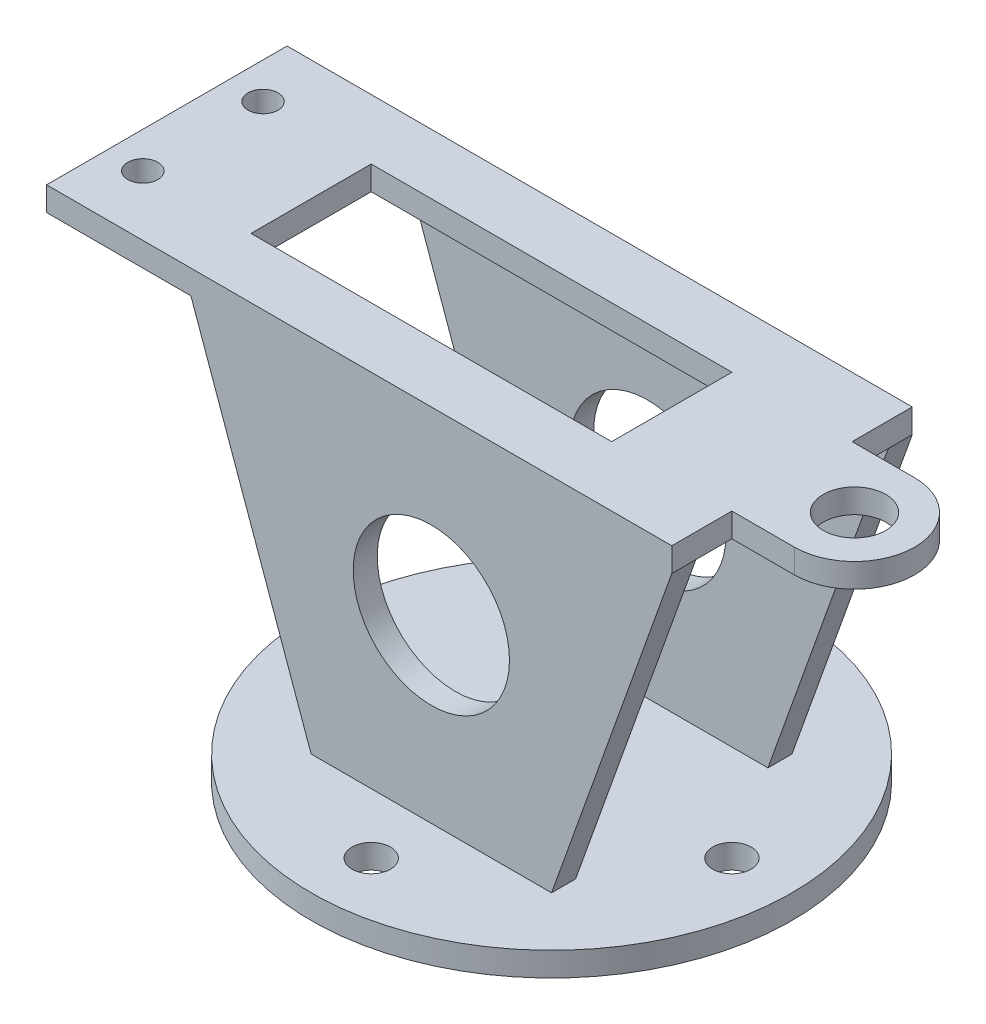
ISO-10303-21;
HEADER;
FILE_DESCRIPTION(('STEP AP214'),'2;1');
FILE_NAME('part.step','',(''),(''),'','','');
FILE_SCHEMA(('AUTOMOTIVE_DESIGN { 1 0 10303 214 1 1 1 1 }'));
ENDSEC;
DATA;
#1=APPLICATION_CONTEXT('core data for automotive mechanical design processes');
#2=APPLICATION_PROTOCOL_DEFINITION('international standard','automotive_design',2000,#1);
#3=PRODUCT_CONTEXT('',#1,'mechanical');
#4=PRODUCT('Part','Part','',(#3));
#5=PRODUCT_RELATED_PRODUCT_CATEGORY('part','',(#4));
#6=PRODUCT_DEFINITION_FORMATION('','',#4);
#7=PRODUCT_DEFINITION_CONTEXT('part definition',#1,'design');
#8=PRODUCT_DEFINITION('design','',#6,#7);
#9=PRODUCT_DEFINITION_SHAPE('','',#8);
#10=(LENGTH_UNIT() NAMED_UNIT(*) SI_UNIT(.MILLI.,.METRE.));
#11=(NAMED_UNIT(*) PLANE_ANGLE_UNIT() SI_UNIT($,.RADIAN.));
#12=(NAMED_UNIT(*) SI_UNIT($,.STERADIAN.) SOLID_ANGLE_UNIT());
#13=UNCERTAINTY_MEASURE_WITH_UNIT(LENGTH_MEASURE(1.E-05),#10,'distance_accuracy_value','');
#14=(GEOMETRIC_REPRESENTATION_CONTEXT(3) GLOBAL_UNCERTAINTY_ASSIGNED_CONTEXT((#13)) GLOBAL_UNIT_ASSIGNED_CONTEXT((#10,
#11,#12)) REPRESENTATION_CONTEXT('',''));
#15=CARTESIAN_POINT('',(0.,0.,0.));
#16=DIRECTION('',(0.,0.,1.));
#17=DIRECTION('',(1.,0.,0.));
#18=AXIS2_PLACEMENT_3D('',#15,#16,#17);
#19=CARTESIAN_POINT('',(50.8,0.,-20.32));
#20=DIRECTION('',(0.,0.,1.));
#21=DIRECTION('',(0.,-1.,0.));
#22=AXIS2_PLACEMENT_3D('',#19,#20,#21);
#23=PLANE('',#22);
#24=CARTESIAN_POINT('',(0.,38.1,-20.32));
#25=DIRECTION('',(0.,0.,1.));
#26=DIRECTION('',(0.,-1.,0.));
#27=AXIS2_PLACEMENT_3D('',#24,#25,#26);
#28=CIRCLE('',#27,16.51);
#29=CARTESIAN_POINT('',(0.,21.59,-20.32));
#30=VERTEX_POINT('',#29);
#31=EDGE_CURVE('E715',#30,#30,#28,.T.);
#32=ORIENTED_EDGE('',*,*,#31,.F.);
#33=EDGE_LOOP('',(#32));
#34=FACE_BOUND('',#33,.T.);
#35=DIRECTION('',(-1.,0.,0.));
#36=VECTOR('',#35,1.);
#37=CARTESIAN_POINT('',(50.8,0.,-20.32));
#38=LINE('',#37,#36);
#39=CARTESIAN_POINT('',(25.4,0.,-20.32));
#40=VERTEX_POINT('',#39);
#41=CARTESIAN_POINT('',(-25.4,0.,-20.32));
#42=VERTEX_POINT('',#41);
#43=EDGE_CURVE('E241',#40,#42,#38,.T.);
#44=ORIENTED_EDGE('',*,*,#43,.F.);
#45=DIRECTION('',(0.336336396998156,0.941741911594838,0.));
#46=VECTOR('',#45,1.);
#47=CARTESIAN_POINT('',(28.2733031674208,8.04524886877828,-20.32));
#48=LINE('',#47,#46);
#49=CARTESIAN_POINT('',(50.8,71.12,-20.32));
#50=VERTEX_POINT('',#49);
#51=EDGE_CURVE('E203',#40,#50,#48,.T.);
#52=ORIENTED_EDGE('',*,*,#51,.T.);
#53=DIRECTION('',(-1.,0.,0.));
#54=VECTOR('',#53,1.);
#55=CARTESIAN_POINT('',(50.8,71.12,-20.32));
#56=LINE('',#55,#54);
#57=CARTESIAN_POINT('',(-50.8,71.12,-20.32));
#58=VERTEX_POINT('',#57);
#59=EDGE_CURVE('E44',#50,#58,#56,.T.);
#60=ORIENTED_EDGE('',*,*,#59,.T.);
#61=DIRECTION('',(0.336336396998156,-0.941741911594838,0.));
#62=VECTOR('',#61,1.);
#63=CARTESIAN_POINT('',(-16.7800904977376,-24.1357466063348,-20.32));
#64=LINE('',#63,#62);
#65=EDGE_CURVE('E279',#58,#42,#64,.T.);
#66=ORIENTED_EDGE('',*,*,#65,.T.);
#67=EDGE_LOOP('',(#44,#52,#60,#66));
#68=FACE_BOUND('',#67,.T.);
#69=ADVANCED_FACE('F35',(#34,#68),#23,.T.);
#70=CARTESIAN_POINT('',(50.8,0.,-25.4));
#71=DIRECTION('',(0.,0.,1.));
#72=DIRECTION('',(1.,0.,0.));
#73=AXIS2_PLACEMENT_3D('',#70,#71,#72);
#74=PLANE('',#73);
#75=CARTESIAN_POINT('',(0.,38.1,-25.4));
#76=DIRECTION('',(0.,0.,1.));
#77=DIRECTION('',(1.,0.,0.));
#78=AXIS2_PLACEMENT_3D('',#75,#76,#77);
#79=CIRCLE('',#78,16.51);
#80=CARTESIAN_POINT('',(16.51,38.1,-25.4));
#81=VERTEX_POINT('',#80);
#82=EDGE_CURVE('E718',#81,#81,#79,.T.);
#83=ORIENTED_EDGE('',*,*,#82,.T.);
#84=EDGE_LOOP('',(#83));
#85=FACE_BOUND('',#84,.T.);
#86=DIRECTION('',(0.336336396998156,0.941741911594838,0.));
#87=VECTOR('',#86,1.);
#88=CARTESIAN_POINT('',(28.2733031674208,8.04524886877828,-25.4));
#89=LINE('',#88,#87);
#90=CARTESIAN_POINT('',(25.4,0.,-25.4));
#91=VERTEX_POINT('',#90);
#92=CARTESIAN_POINT('',(50.8,71.12,-25.4000025));
#93=VERTEX_POINT('',#92);
#94=EDGE_CURVE('E52',#91,#93,#89,.T.);
#95=ORIENTED_EDGE('',*,*,#94,.F.);
#96=DIRECTION('',(-1.,0.,0.));
#97=VECTOR('',#96,1.);
#98=CARTESIAN_POINT('',(50.8,0.,-25.4));
#99=LINE('',#98,#97);
#100=CARTESIAN_POINT('',(-25.4,0.,-25.4));
#101=VERTEX_POINT('',#100);
#102=EDGE_CURVE('E244',#91,#101,#99,.T.);
#103=ORIENTED_EDGE('',*,*,#102,.T.);
#104=DIRECTION('',(0.336336396998156,-0.941741911594838,0.));
#105=VECTOR('',#104,1.);
#106=CARTESIAN_POINT('',(-16.7800904977376,-24.1357466063348,-25.4));
#107=LINE('',#106,#105);
#108=CARTESIAN_POINT('',(-50.8,71.12,-25.4000225));
#109=VERTEX_POINT('',#108);
#110=EDGE_CURVE('E278',#109,#101,#107,.T.);
#111=ORIENTED_EDGE('',*,*,#110,.F.);
#112=DIRECTION('',(-1.,0.,0.));
#113=VECTOR('',#112,1.);
#114=CARTESIAN_POINT('',(0.,71.12,-25.4));
#115=LINE('',#114,#113);
#116=CARTESIAN_POINT('',(-81.28,71.12,-25.4));
#117=VERTEX_POINT('',#116);
#118=EDGE_CURVE('E266',#109,#117,#115,.T.);
#119=ORIENTED_EDGE('',*,*,#118,.T.);
#120=DIRECTION('',(0.,1.,0.));
#121=VECTOR('',#120,1.);
#122=CARTESIAN_POINT('',(-81.28,11.8775287483717,-25.4));
#123=LINE('',#122,#121);
#124=CARTESIAN_POINT('',(-81.28,76.2,-25.4));
#125=VERTEX_POINT('',#124);
#126=EDGE_CURVE('E268',#117,#125,#123,.T.);
#127=ORIENTED_EDGE('',*,*,#126,.T.);
#128=DIRECTION('',(-1.,0.,0.));
#129=VECTOR('',#128,1.);
#130=CARTESIAN_POINT('',(50.8,76.2,-25.4));
#131=LINE('',#130,#129);
#132=CARTESIAN_POINT('',(50.8,76.2,-25.4));
#133=VERTEX_POINT('',#132);
#134=EDGE_CURVE('E246',#133,#125,#131,.T.);
#135=ORIENTED_EDGE('',*,*,#134,.F.);
#136=DIRECTION('',(0.,1.,0.));
#137=VECTOR('',#136,1.);
#138=CARTESIAN_POINT('',(50.8,0.,-25.4));
#139=LINE('',#138,#137);
#140=EDGE_CURVE('E215',#93,#133,#139,.T.);
#141=ORIENTED_EDGE('',*,*,#140,.F.);
#142=EDGE_LOOP('',(#95,#103,#111,#119,#127,#135,#141));
#143=FACE_BOUND('',#142,.T.);
#144=ADVANCED_FACE('F428',(#85,#143),#74,.F.);
#145=CARTESIAN_POINT('',(50.8,0.,25.4));
#146=DIRECTION('',(0.,0.,1.));
#147=DIRECTION('',(1.,0.,0.));
#148=AXIS2_PLACEMENT_3D('',#145,#146,#147);
#149=PLANE('',#148);
#150=CARTESIAN_POINT('',(0.,38.1,25.4));
#151=DIRECTION('',(0.,0.,1.));
#152=DIRECTION('',(1.,0.,0.));
#153=AXIS2_PLACEMENT_3D('',#150,#151,#152);
#154=CIRCLE('',#153,16.51);
#155=CARTESIAN_POINT('',(16.51,38.1,25.4));
#156=VERTEX_POINT('',#155);
#157=EDGE_CURVE('E722',#156,#156,#154,.T.);
#158=ORIENTED_EDGE('',*,*,#157,.F.);
#159=EDGE_LOOP('',(#158));
#160=FACE_BOUND('',#159,.T.);
#161=DIRECTION('',(-1.,0.,0.));
#162=VECTOR('',#161,1.);
#163=CARTESIAN_POINT('',(50.8,0.,25.4));
#164=LINE('',#163,#162);
#165=CARTESIAN_POINT('',(25.4,0.,25.4));
#166=VERTEX_POINT('',#165);
#167=CARTESIAN_POINT('',(-25.4,0.,25.4));
#168=VERTEX_POINT('',#167);
#169=EDGE_CURVE('E169',#166,#168,#164,.T.);
#170=ORIENTED_EDGE('',*,*,#169,.F.);
#171=DIRECTION('',(0.336336396998156,0.941741911594837,0.));
#172=VECTOR('',#171,1.);
#173=CARTESIAN_POINT('',(22.5266968325792,-8.04524886877828,25.4));
#174=LINE('',#173,#172);
#175=CARTESIAN_POINT('',(50.8,71.12,25.4));
#176=VERTEX_POINT('',#175);
#177=EDGE_CURVE('E172',#166,#176,#174,.T.);
#178=ORIENTED_EDGE('',*,*,#177,.T.);
#179=DIRECTION('',(0.,1.,0.));
#180=VECTOR('',#179,1.);
#181=CARTESIAN_POINT('',(50.8,0.,25.4));
#182=LINE('',#181,#180);
#183=CARTESIAN_POINT('',(50.8,76.2,25.4));
#184=VERTEX_POINT('',#183);
#185=EDGE_CURVE('E226',#176,#184,#182,.T.);
#186=ORIENTED_EDGE('',*,*,#185,.T.);
#187=DIRECTION('',(-1.,0.,0.));
#188=VECTOR('',#187,1.);
#189=CARTESIAN_POINT('',(50.8,76.2,25.4));
#190=LINE('',#189,#188);
#191=CARTESIAN_POINT('',(-81.28,76.2,25.4));
#192=VERTEX_POINT('',#191);
#193=EDGE_CURVE('E179',#184,#192,#190,.T.);
#194=ORIENTED_EDGE('',*,*,#193,.T.);
#195=DIRECTION('',(0.,1.,0.));
#196=VECTOR('',#195,1.);
#197=CARTESIAN_POINT('',(-81.28,11.8775287483717,25.4));
#198=LINE('',#197,#196);
#199=CARTESIAN_POINT('',(-81.28,71.12,25.4));
#200=VERTEX_POINT('',#199);
#201=EDGE_CURVE('E269',#200,#192,#198,.T.);
#202=ORIENTED_EDGE('',*,*,#201,.F.);
#203=DIRECTION('',(-1.,0.,0.));
#204=VECTOR('',#203,1.);
#205=CARTESIAN_POINT('',(0.,71.12,25.4));
#206=LINE('',#205,#204);
#207=CARTESIAN_POINT('',(-50.8,71.12,25.4));
#208=VERTEX_POINT('',#207);
#209=EDGE_CURVE('E333',#208,#200,#206,.T.);
#210=ORIENTED_EDGE('',*,*,#209,.F.);
#211=DIRECTION('',(0.336336396998156,-0.941741911594837,0.));
#212=VECTOR('',#211,1.);
#213=CARTESIAN_POINT('',(-22.5266968325792,-8.04524886877828,25.4));
#214=LINE('',#213,#212);
#215=EDGE_CURVE('E175',#208,#168,#214,.T.);
#216=ORIENTED_EDGE('',*,*,#215,.T.);
#217=EDGE_LOOP('',(#170,#178,#186,#194,#202,#210,#216));
#218=FACE_BOUND('',#217,.T.);
#219=ADVANCED_FACE('F171',(#160,#218),#149,.T.);
#220=CARTESIAN_POINT('',(50.8,0.,20.32));
#221=DIRECTION('',(0.,0.,1.));
#222=DIRECTION('',(0.,-1.,0.));
#223=AXIS2_PLACEMENT_3D('',#220,#221,#222);
#224=PLANE('',#223);
#225=CARTESIAN_POINT('',(0.,38.1,20.32));
#226=DIRECTION('',(0.,0.,1.));
#227=DIRECTION('',(0.,-1.,0.));
#228=AXIS2_PLACEMENT_3D('',#225,#226,#227);
#229=CIRCLE('',#228,16.51);
#230=CARTESIAN_POINT('',(0.,21.59,20.32));
#231=VERTEX_POINT('',#230);
#232=EDGE_CURVE('E39',#231,#231,#229,.T.);
#233=ORIENTED_EDGE('',*,*,#232,.T.);
#234=EDGE_LOOP('',(#233));
#235=FACE_BOUND('',#234,.T.);
#236=DIRECTION('',(0.336336396998156,0.941741911594838,0.));
#237=VECTOR('',#236,1.);
#238=CARTESIAN_POINT('',(28.2733031674208,8.04524886877828,20.32));
#239=LINE('',#238,#237);
#240=CARTESIAN_POINT('',(25.4,0.,20.32));
#241=VERTEX_POINT('',#240);
#242=CARTESIAN_POINT('',(50.8,71.12,20.32));
#243=VERTEX_POINT('',#242);
#244=EDGE_CURVE('E201',#241,#243,#239,.T.);
#245=ORIENTED_EDGE('',*,*,#244,.F.);
#246=DIRECTION('',(-1.,0.,0.));
#247=VECTOR('',#246,1.);
#248=CARTESIAN_POINT('',(50.8,0.,20.32));
#249=LINE('',#248,#247);
#250=CARTESIAN_POINT('',(-25.4,0.,20.32));
#251=VERTEX_POINT('',#250);
#252=EDGE_CURVE('E180',#241,#251,#249,.T.);
#253=ORIENTED_EDGE('',*,*,#252,.T.);
#254=DIRECTION('',(0.336336396998156,-0.941741911594838,0.));
#255=VECTOR('',#254,1.);
#256=CARTESIAN_POINT('',(-16.7800904977376,-24.1357466063348,20.32));
#257=LINE('',#256,#255);
#258=CARTESIAN_POINT('',(-50.8,71.12,20.32));
#259=VERTEX_POINT('',#258);
#260=EDGE_CURVE('E273',#259,#251,#257,.T.);
#261=ORIENTED_EDGE('',*,*,#260,.F.);
#262=DIRECTION('',(-1.,0.,0.));
#263=VECTOR('',#262,1.);
#264=CARTESIAN_POINT('',(50.8,71.12,20.32));
#265=LINE('',#264,#263);
#266=EDGE_CURVE('E248',#243,#259,#265,.T.);
#267=ORIENTED_EDGE('',*,*,#266,.F.);
#268=EDGE_LOOP('',(#245,#253,#261,#267));
#269=FACE_BOUND('',#268,.T.);
#270=ADVANCED_FACE('F418',(#235,#269),#224,.F.);
#271=CARTESIAN_POINT('',(50.8,0.,0.));
#272=DIRECTION('',(1.,0.,0.));
#273=DIRECTION('',(0.,0.,-1.));
#274=AXIS2_PLACEMENT_3D('',#271,#272,#273);
#275=PLANE('',#274);
#276=ORIENTED_EDGE('',*,*,#185,.F.);
#277=DIRECTION('',(0.,0.,1.));
#278=VECTOR('',#277,1.);
#279=CARTESIAN_POINT('',(50.8,71.12,-25.40005));
#280=LINE('',#279,#278);
#281=EDGE_CURVE('E187',#243,#176,#280,.T.);
#282=ORIENTED_EDGE('',*,*,#281,.F.);
#283=DIRECTION('',(0.,0.,1.));
#284=VECTOR('',#283,1.);
#285=CARTESIAN_POINT('',(50.8,71.12,0.));
#286=LINE('',#285,#284);
#287=CARTESIAN_POINT('',(50.8,71.12,12.7));
#288=VERTEX_POINT('',#287);
#289=EDGE_CURVE('E235',#288,#243,#286,.T.);
#290=ORIENTED_EDGE('',*,*,#289,.F.);
#291=DIRECTION('',(0.,1.,0.));
#292=VECTOR('',#291,1.);
#293=CARTESIAN_POINT('',(50.8,11.8775287483717,12.7));
#294=LINE('',#293,#292);
#295=CARTESIAN_POINT('',(50.8,76.2,12.7));
#296=VERTEX_POINT('',#295);
#297=EDGE_CURVE('E352',#288,#296,#294,.T.);
#298=ORIENTED_EDGE('',*,*,#297,.T.);
#299=DIRECTION('',(0.,0.,-1.));
#300=VECTOR('',#299,1.);
#301=CARTESIAN_POINT('',(50.8,76.2,0.));
#302=LINE('',#301,#300);
#303=EDGE_CURVE('E232',#184,#296,#302,.T.);
#304=ORIENTED_EDGE('',*,*,#303,.F.);
#305=EDGE_LOOP('',(#276,#282,#290,#298,#304));
#306=FACE_BOUND('',#305,.T.);
#307=ADVANCED_FACE('F405',(#306),#275,.T.);
#308=CARTESIAN_POINT('',(50.8,71.12,-12.7));
#309=VERTEX_POINT('',#308);
#310=EDGE_CURVE('E218',#50,#309,#286,.T.);
#311=ORIENTED_EDGE('',*,*,#310,.F.);
#312=EDGE_CURVE('E200',#93,#50,#280,.T.);
#313=ORIENTED_EDGE('',*,*,#312,.F.);
#314=ORIENTED_EDGE('',*,*,#140,.T.);
#315=CARTESIAN_POINT('',(50.8,76.2,-12.7));
#316=VERTEX_POINT('',#315);
#317=EDGE_CURVE('E217',#316,#133,#302,.T.);
#318=ORIENTED_EDGE('',*,*,#317,.F.);
#319=DIRECTION('',(0.,1.,0.));
#320=VECTOR('',#319,1.);
#321=CARTESIAN_POINT('',(50.8,11.8775287483717,-12.7));
#322=LINE('',#321,#320);
#323=EDGE_CURVE('E351',#309,#316,#322,.T.);
#324=ORIENTED_EDGE('',*,*,#323,.F.);
#325=EDGE_LOOP('',(#311,#313,#314,#318,#324));
#326=FACE_BOUND('',#325,.T.);
#327=ADVANCED_FACE('F426',(#326),#275,.T.);
#328=CARTESIAN_POINT('',(50.8,71.12,0.));
#329=DIRECTION('',(0.,-1.,0.));
#330=DIRECTION('',(0.,0.,-1.));
#331=AXIS2_PLACEMENT_3D('',#328,#329,#330);
#332=PLANE('',#331);
#333=DIRECTION('',(1.,0.,0.));
#334=VECTOR('',#333,1.);
#335=CARTESIAN_POINT('',(0.,71.12,12.7));
#336=LINE('',#335,#334);
#337=CARTESIAN_POINT('',(64.008,71.12,12.7));
#338=VERTEX_POINT('',#337);
#339=EDGE_CURVE('E361',#288,#338,#336,.T.);
#340=ORIENTED_EDGE('',*,*,#339,.F.);
#341=ORIENTED_EDGE('',*,*,#289,.T.);
#342=ORIENTED_EDGE('',*,*,#266,.T.);
#343=DIRECTION('',(0.,0.,1.));
#344=VECTOR('',#343,1.);
#345=CARTESIAN_POINT('',(-50.8,71.12,0.));
#346=LINE('',#345,#344);
#347=EDGE_CURVE('E11',#259,#208,#346,.T.);
#348=ORIENTED_EDGE('',*,*,#347,.T.);
#349=ORIENTED_EDGE('',*,*,#209,.T.);
#350=DIRECTION('',(0.,0.,1.));
#351=VECTOR('',#350,1.);
#352=CARTESIAN_POINT('',(-81.28,71.12,0.));
#353=LINE('',#352,#351);
#354=EDGE_CURVE('E315',#117,#200,#353,.T.);
#355=ORIENTED_EDGE('',*,*,#354,.F.);
#356=ORIENTED_EDGE('',*,*,#118,.F.);
#357=EDGE_CURVE('E323',#109,#58,#346,.T.);
#358=ORIENTED_EDGE('',*,*,#357,.T.);
#359=ORIENTED_EDGE('',*,*,#59,.F.);
#360=ORIENTED_EDGE('',*,*,#310,.T.);
#361=DIRECTION('',(1.,0.,0.));
#362=VECTOR('',#361,1.);
#363=CARTESIAN_POINT('',(0.,71.12,-12.7));
#364=LINE('',#363,#362);
#365=CARTESIAN_POINT('',(64.008,71.12,-12.7));
#366=VERTEX_POINT('',#365);
#367=EDGE_CURVE('E355',#309,#366,#364,.T.);
#368=ORIENTED_EDGE('',*,*,#367,.T.);
#369=CARTESIAN_POINT('',(64.008,71.12,0.));
#370=DIRECTION('',(0.,-1.,0.));
#371=DIRECTION('',(0.,0.,-1.));
#372=AXIS2_PLACEMENT_3D('',#369,#370,#371);
#373=CIRCLE('',#372,12.7);
#374=EDGE_CURVE('E329',#338,#366,#373,.F.);
#375=ORIENTED_EDGE('',*,*,#374,.F.);
#376=EDGE_LOOP('',(#340,#341,#342,#348,#349,#355,#356,#358,#359,#360,#368,#375));
#377=FACE_BOUND('',#376,.T.);
#378=CARTESIAN_POINT('',(64.008,71.12,0.));
#379=DIRECTION('',(0.,-1.,0.));
#380=DIRECTION('',(0.,0.,-1.));
#381=AXIS2_PLACEMENT_3D('',#378,#379,#380);
#382=CIRCLE('',#381,6.604);
#383=CARTESIAN_POINT('',(64.008,71.12,-6.604));
#384=VERTEX_POINT('',#383);
#385=EDGE_CURVE('E238',#384,#384,#382,.F.);
#386=ORIENTED_EDGE('',*,*,#385,.T.);
#387=EDGE_LOOP('',(#386));
#388=FACE_BOUND('',#387,.T.);
#389=CARTESIAN_POINT('',(-73.66,71.12,-12.7));
#390=DIRECTION('',(0.,-1.,0.));
#391=DIRECTION('',(0.,0.,-1.));
#392=AXIS2_PLACEMENT_3D('',#389,#390,#391);
#393=CIRCLE('',#392,3.175);
#394=CARTESIAN_POINT('',(-73.66,71.12,-15.875));
#395=VERTEX_POINT('',#394);
#396=EDGE_CURVE('E326',#395,#395,#393,.F.);
#397=ORIENTED_EDGE('',*,*,#396,.T.);
#398=EDGE_LOOP('',(#397));
#399=FACE_BOUND('',#398,.T.);
#400=CARTESIAN_POINT('',(-73.66,71.12,12.7));
#401=DIRECTION('',(0.,-1.,0.));
#402=DIRECTION('',(0.,0.,-1.));
#403=AXIS2_PLACEMENT_3D('',#400,#401,#402);
#404=CIRCLE('',#403,3.175);
#405=CARTESIAN_POINT('',(-73.66,71.12,9.525));
#406=VERTEX_POINT('',#405);
#407=EDGE_CURVE('E330',#406,#406,#404,.F.);
#408=ORIENTED_EDGE('',*,*,#407,.T.);
#409=EDGE_LOOP('',(#408));
#410=FACE_BOUND('',#409,.T.);
#411=DIRECTION('',(0.,0.,-1.));
#412=VECTOR('',#411,1.);
#413=CARTESIAN_POINT('',(-50.8,71.12,0.));
#414=LINE('',#413,#412);
#415=CARTESIAN_POINT('',(-50.8,71.12,12.7));
#416=VERTEX_POINT('',#415);
#417=CARTESIAN_POINT('',(-50.8,71.12,-12.7));
#418=VERTEX_POINT('',#417);
#419=EDGE_CURVE('E313',#416,#418,#414,.T.);
#420=ORIENTED_EDGE('',*,*,#419,.F.);
#421=DIRECTION('',(-1.,0.,0.));
#422=VECTOR('',#421,1.);
#423=CARTESIAN_POINT('',(50.8,71.12,12.6999999999999));
#424=LINE('',#423,#422);
#425=CARTESIAN_POINT('',(25.4,71.12,12.7));
#426=VERTEX_POINT('',#425);
#427=EDGE_CURVE('E302',#426,#416,#424,.T.);
#428=ORIENTED_EDGE('',*,*,#427,.F.);
#429=DIRECTION('',(0.,0.,1.));
#430=VECTOR('',#429,1.);
#431=CARTESIAN_POINT('',(25.4,71.12,0.));
#432=LINE('',#431,#430);
#433=CARTESIAN_POINT('',(25.4,71.12,-12.7));
#434=VERTEX_POINT('',#433);
#435=EDGE_CURVE('E309',#434,#426,#432,.T.);
#436=ORIENTED_EDGE('',*,*,#435,.F.);
#437=DIRECTION('',(1.,0.,0.));
#438=VECTOR('',#437,1.);
#439=CARTESIAN_POINT('',(50.8,71.12,-12.7));
#440=LINE('',#439,#438);
#441=EDGE_CURVE('E311',#418,#434,#440,.T.);
#442=ORIENTED_EDGE('',*,*,#441,.F.);
#443=EDGE_LOOP('',(#420,#428,#436,#442));
#444=FACE_BOUND('',#443,.T.);
#445=ADVANCED_FACE('F37',(#377,#388,#399,#410,#444),#332,.T.);
#446=CARTESIAN_POINT('',(50.8,76.2,0.));
#447=DIRECTION('',(0.,1.,0.));
#448=DIRECTION('',(0.,0.,1.));
#449=AXIS2_PLACEMENT_3D('',#446,#447,#448);
#450=PLANE('',#449);
#451=DIRECTION('',(0.,0.,1.));
#452=VECTOR('',#451,1.);
#453=CARTESIAN_POINT('',(-50.8,76.2,-12.7));
#454=LINE('',#453,#452);
#455=CARTESIAN_POINT('',(-50.8,76.2,-12.7));
#456=VERTEX_POINT('',#455);
#457=CARTESIAN_POINT('',(-50.8,76.2,12.7));
#458=VERTEX_POINT('',#457);
#459=EDGE_CURVE('E287',#456,#458,#454,.T.);
#460=ORIENTED_EDGE('',*,*,#459,.F.);
#461=DIRECTION('',(-1.,0.,0.));
#462=VECTOR('',#461,1.);
#463=CARTESIAN_POINT('',(-50.8,76.2,-12.7));
#464=LINE('',#463,#462);
#465=CARTESIAN_POINT('',(25.4,76.2,-12.7));
#466=VERTEX_POINT('',#465);
#467=EDGE_CURVE('E296',#466,#456,#464,.T.);
#468=ORIENTED_EDGE('',*,*,#467,.F.);
#469=DIRECTION('',(0.,0.,-1.));
#470=VECTOR('',#469,1.);
#471=CARTESIAN_POINT('',(25.4,76.2,-12.7));
#472=LINE('',#471,#470);
#473=CARTESIAN_POINT('',(25.4,76.2,12.7));
#474=VERTEX_POINT('',#473);
#475=EDGE_CURVE('E293',#474,#466,#472,.T.);
#476=ORIENTED_EDGE('',*,*,#475,.F.);
#477=DIRECTION('',(1.,0.,0.));
#478=VECTOR('',#477,1.);
#479=CARTESIAN_POINT('',(-50.8,76.2,12.7));
#480=LINE('',#479,#478);
#481=EDGE_CURVE('E291',#458,#474,#480,.T.);
#482=ORIENTED_EDGE('',*,*,#481,.F.);
#483=EDGE_LOOP('',(#460,#468,#476,#482));
#484=FACE_BOUND('',#483,.T.);
#485=ORIENTED_EDGE('',*,*,#134,.T.);
#486=DIRECTION('',(0.,0.,1.));
#487=VECTOR('',#486,1.);
#488=CARTESIAN_POINT('',(-81.28,76.2,0.));
#489=LINE('',#488,#487);
#490=EDGE_CURVE('E319',#125,#192,#489,.T.);
#491=ORIENTED_EDGE('',*,*,#490,.T.);
#492=ORIENTED_EDGE('',*,*,#193,.F.);
#493=ORIENTED_EDGE('',*,*,#303,.T.);
#494=DIRECTION('',(1.,0.,0.));
#495=VECTOR('',#494,1.);
#496=CARTESIAN_POINT('',(0.,76.2,12.7));
#497=LINE('',#496,#495);
#498=CARTESIAN_POINT('',(64.008,76.2,12.7));
#499=VERTEX_POINT('',#498);
#500=EDGE_CURVE('E346',#296,#499,#497,.T.);
#501=ORIENTED_EDGE('',*,*,#500,.T.);
#502=CARTESIAN_POINT('',(64.008,76.2,0.));
#503=DIRECTION('',(0.,1.,0.));
#504=DIRECTION('',(0.,0.,1.));
#505=AXIS2_PLACEMENT_3D('',#502,#503,#504);
#506=CIRCLE('',#505,12.7);
#507=CARTESIAN_POINT('',(64.008,76.2,-12.7));
#508=VERTEX_POINT('',#507);
#509=EDGE_CURVE('E343',#499,#508,#506,.T.);
#510=ORIENTED_EDGE('',*,*,#509,.T.);
#511=DIRECTION('',(1.,0.,0.));
#512=VECTOR('',#511,1.);
#513=CARTESIAN_POINT('',(0.,76.2,-12.7));
#514=LINE('',#513,#512);
#515=EDGE_CURVE('E347',#316,#508,#514,.T.);
#516=ORIENTED_EDGE('',*,*,#515,.F.);
#517=ORIENTED_EDGE('',*,*,#317,.T.);
#518=EDGE_LOOP('',(#485,#491,#492,#493,#501,#510,#516,#517));
#519=FACE_BOUND('',#518,.T.);
#520=CARTESIAN_POINT('',(64.008,76.2,0.));
#521=DIRECTION('',(0.,1.,0.));
#522=DIRECTION('',(0.,0.,1.));
#523=AXIS2_PLACEMENT_3D('',#520,#521,#522);
#524=CIRCLE('',#523,6.604);
#525=CARTESIAN_POINT('',(64.008,76.2,6.604));
#526=VERTEX_POINT('',#525);
#527=EDGE_CURVE('E348',#526,#526,#524,.T.);
#528=ORIENTED_EDGE('',*,*,#527,.F.);
#529=EDGE_LOOP('',(#528));
#530=FACE_BOUND('',#529,.T.);
#531=CARTESIAN_POINT('',(-73.66,76.2,-12.7));
#532=DIRECTION('',(0.,1.,0.));
#533=DIRECTION('',(0.,0.,1.));
#534=AXIS2_PLACEMENT_3D('',#531,#532,#533);
#535=CIRCLE('',#534,3.175);
#536=CARTESIAN_POINT('',(-73.66,76.2,-9.525));
#537=VERTEX_POINT('',#536);
#538=EDGE_CURVE('E320',#537,#537,#535,.T.);
#539=ORIENTED_EDGE('',*,*,#538,.F.);
#540=EDGE_LOOP('',(#539));
#541=FACE_BOUND('',#540,.T.);
#542=CARTESIAN_POINT('',(-73.66,76.2,12.7));
#543=DIRECTION('',(0.,1.,0.));
#544=DIRECTION('',(0.,0.,1.));
#545=AXIS2_PLACEMENT_3D('',#542,#543,#544);
#546=CIRCLE('',#545,3.175);
#547=CARTESIAN_POINT('',(-73.66,76.2,15.875));
#548=VERTEX_POINT('',#547);
#549=EDGE_CURVE('E316',#548,#548,#546,.T.);
#550=ORIENTED_EDGE('',*,*,#549,.F.);
#551=EDGE_LOOP('',(#550));
#552=FACE_BOUND('',#551,.T.);
#553=ADVANCED_FACE('F391',(#484,#519,#530,#541,#552),#450,.T.);
#554=CARTESIAN_POINT('',(64.008,11.8775287483717,0.));
#555=DIRECTION('',(0.,1.,0.));
#556=DIRECTION('',(0.,0.,1.));
#557=AXIS2_PLACEMENT_3D('',#554,#555,#556);
#558=CYLINDRICAL_SURFACE('',#557,12.7);
#559=DIRECTION('',(0.,1.,0.));
#560=VECTOR('',#559,1.);
#561=CARTESIAN_POINT('',(64.008,11.8775287483717,12.7));
#562=LINE('',#561,#560);
#563=EDGE_CURVE('E359',#338,#499,#562,.T.);
#564=ORIENTED_EDGE('',*,*,#563,.F.);
#565=ORIENTED_EDGE('',*,*,#374,.T.);
#566=DIRECTION('',(0.,1.,0.));
#567=VECTOR('',#566,1.);
#568=CARTESIAN_POINT('',(64.008,11.8775287483717,-12.7));
#569=LINE('',#568,#567);
#570=EDGE_CURVE('E358',#366,#508,#569,.T.);
#571=ORIENTED_EDGE('',*,*,#570,.T.);
#572=ORIENTED_EDGE('',*,*,#509,.F.);
#573=EDGE_LOOP('',(#564,#565,#571,#572));
#574=FACE_BOUND('',#573,.T.);
#575=ADVANCED_FACE('F397',(#574),#558,.T.);
#576=CARTESIAN_POINT('',(0.,11.8775287483717,12.7));
#577=DIRECTION('',(0.,0.,1.));
#578=DIRECTION('',(1.,0.,0.));
#579=AXIS2_PLACEMENT_3D('',#576,#577,#578);
#580=PLANE('',#579);
#581=ORIENTED_EDGE('',*,*,#297,.F.);
#582=ORIENTED_EDGE('',*,*,#339,.T.);
#583=ORIENTED_EDGE('',*,*,#563,.T.);
#584=ORIENTED_EDGE('',*,*,#500,.F.);
#585=EDGE_LOOP('',(#581,#582,#583,#584));
#586=FACE_BOUND('',#585,.T.);
#587=ADVANCED_FACE('F402',(#586),#580,.T.);
#588=CARTESIAN_POINT('',(64.008,11.8775287483717,0.));
#589=DIRECTION('',(0.,1.,0.));
#590=DIRECTION('',(0.,0.,1.));
#591=AXIS2_PLACEMENT_3D('',#588,#589,#590);
#592=CYLINDRICAL_SURFACE('',#591,6.604);
#593=ORIENTED_EDGE('',*,*,#527,.T.);
#594=EDGE_LOOP('',(#593));
#595=FACE_BOUND('',#594,.T.);
#596=ORIENTED_EDGE('',*,*,#385,.F.);
#597=EDGE_LOOP('',(#596));
#598=FACE_BOUND('',#597,.T.);
#599=ADVANCED_FACE('F490',(#595,#598),#592,.F.);
#600=CARTESIAN_POINT('',(0.,11.8775287483717,-12.7));
#601=DIRECTION('',(0.,0.,1.));
#602=DIRECTION('',(1.,0.,0.));
#603=AXIS2_PLACEMENT_3D('',#600,#601,#602);
#604=PLANE('',#603);
#605=ORIENTED_EDGE('',*,*,#367,.F.);
#606=ORIENTED_EDGE('',*,*,#323,.T.);
#607=ORIENTED_EDGE('',*,*,#515,.T.);
#608=ORIENTED_EDGE('',*,*,#570,.F.);
#609=EDGE_LOOP('',(#605,#606,#607,#608));
#610=FACE_BOUND('',#609,.T.);
#611=ADVANCED_FACE('F387',(#610),#604,.F.);
#612=CARTESIAN_POINT('',(-81.28,11.8775287483717,0.));
#613=DIRECTION('',(-1.,0.,0.));
#614=DIRECTION('',(0.,0.,1.));
#615=AXIS2_PLACEMENT_3D('',#612,#613,#614);
#616=PLANE('',#615);
#617=ORIENTED_EDGE('',*,*,#126,.F.);
#618=ORIENTED_EDGE('',*,*,#354,.T.);
#619=ORIENTED_EDGE('',*,*,#201,.T.);
#620=ORIENTED_EDGE('',*,*,#490,.F.);
#621=EDGE_LOOP('',(#617,#618,#619,#620));
#622=FACE_BOUND('',#621,.T.);
#623=ADVANCED_FACE('F412',(#622),#616,.T.);
#624=CARTESIAN_POINT('',(-73.66,11.8775287483717,-12.7));
#625=DIRECTION('',(0.,1.,0.));
#626=DIRECTION('',(0.,0.,1.));
#627=AXIS2_PLACEMENT_3D('',#624,#625,#626);
#628=CYLINDRICAL_SURFACE('',#627,3.175);
#629=ORIENTED_EDGE('',*,*,#538,.T.);
#630=EDGE_LOOP('',(#629));
#631=FACE_BOUND('',#630,.T.);
#632=ORIENTED_EDGE('',*,*,#396,.F.);
#633=EDGE_LOOP('',(#632));
#634=FACE_BOUND('',#633,.T.);
#635=ADVANCED_FACE('F483',(#631,#634),#628,.F.);
#636=CARTESIAN_POINT('',(-73.66,11.8775287483717,12.7));
#637=DIRECTION('',(0.,1.,0.));
#638=DIRECTION('',(0.,0.,1.));
#639=AXIS2_PLACEMENT_3D('',#636,#637,#638);
#640=CYLINDRICAL_SURFACE('',#639,3.175);
#641=ORIENTED_EDGE('',*,*,#549,.T.);
#642=EDGE_LOOP('',(#641));
#643=FACE_BOUND('',#642,.T.);
#644=ORIENTED_EDGE('',*,*,#407,.F.);
#645=EDGE_LOOP('',(#644));
#646=FACE_BOUND('',#645,.T.);
#647=ADVANCED_FACE('F480',(#643,#646),#640,.F.);
#648=CARTESIAN_POINT('',(-50.8,-2.50000000007189E-05,-12.7));
#649=DIRECTION('',(-1.,0.,0.));
#650=DIRECTION('',(0.,0.,1.));
#651=AXIS2_PLACEMENT_3D('',#648,#649,#650);
#652=PLANE('',#651);
#653=ORIENTED_EDGE('',*,*,#419,.T.);
#654=DIRECTION('',(0.,1.,0.));
#655=VECTOR('',#654,1.);
#656=CARTESIAN_POINT('',(-50.8,-2.50000000007189E-05,-12.7));
#657=LINE('',#656,#655);
#658=EDGE_CURVE('E300',#418,#456,#657,.T.);
#659=ORIENTED_EDGE('',*,*,#658,.T.);
#660=ORIENTED_EDGE('',*,*,#459,.T.);
#661=DIRECTION('',(0.,1.,0.));
#662=VECTOR('',#661,1.);
#663=CARTESIAN_POINT('',(-50.8,-2.50000000007189E-05,12.7));
#664=LINE('',#663,#662);
#665=EDGE_CURVE('E299',#416,#458,#664,.T.);
#666=ORIENTED_EDGE('',*,*,#665,.F.);
#667=EDGE_LOOP('',(#653,#659,#660,#666));
#668=FACE_BOUND('',#667,.T.);
#669=ADVANCED_FACE('F455',(#668),#652,.F.);
#670=CARTESIAN_POINT('',(-50.8,-2.50000000007189E-05,-12.7));
#671=DIRECTION('',(0.,0.,-1.));
#672=DIRECTION('',(-1.,0.,0.));
#673=AXIS2_PLACEMENT_3D('',#670,#671,#672);
#674=PLANE('',#673);
#675=ORIENTED_EDGE('',*,*,#441,.T.);
#676=DIRECTION('',(0.,1.,0.));
#677=VECTOR('',#676,1.);
#678=CARTESIAN_POINT('',(25.4,-2.50000000007189E-05,-12.7));
#679=LINE('',#678,#677);
#680=EDGE_CURVE('E303',#434,#466,#679,.T.);
#681=ORIENTED_EDGE('',*,*,#680,.T.);
#682=ORIENTED_EDGE('',*,*,#467,.T.);
#683=ORIENTED_EDGE('',*,*,#658,.F.);
#684=EDGE_LOOP('',(#675,#681,#682,#683));
#685=FACE_BOUND('',#684,.T.);
#686=ADVANCED_FACE('F464',(#685),#674,.F.);
#687=CARTESIAN_POINT('',(25.4,-2.50000000007189E-05,-12.7));
#688=DIRECTION('',(1.,0.,0.));
#689=DIRECTION('',(0.,0.,-1.));
#690=AXIS2_PLACEMENT_3D('',#687,#688,#689);
#691=PLANE('',#690);
#692=ORIENTED_EDGE('',*,*,#435,.T.);
#693=DIRECTION('',(0.,1.,0.));
#694=VECTOR('',#693,1.);
#695=CARTESIAN_POINT('',(25.4,-2.50000000007189E-05,12.7));
#696=LINE('',#695,#694);
#697=EDGE_CURVE('E60',#426,#474,#696,.T.);
#698=ORIENTED_EDGE('',*,*,#697,.T.);
#699=ORIENTED_EDGE('',*,*,#475,.T.);
#700=ORIENTED_EDGE('',*,*,#680,.F.);
#701=EDGE_LOOP('',(#692,#698,#699,#700));
#702=FACE_BOUND('',#701,.T.);
#703=ADVANCED_FACE('F467',(#702),#691,.F.);
#704=CARTESIAN_POINT('',(-50.8,-2.50000000007189E-05,12.7));
#705=DIRECTION('',(0.,0.,1.));
#706=DIRECTION('',(1.,0.,0.));
#707=AXIS2_PLACEMENT_3D('',#704,#705,#706);
#708=PLANE('',#707);
#709=ORIENTED_EDGE('',*,*,#427,.T.);
#710=ORIENTED_EDGE('',*,*,#665,.T.);
#711=ORIENTED_EDGE('',*,*,#481,.T.);
#712=ORIENTED_EDGE('',*,*,#697,.F.);
#713=EDGE_LOOP('',(#709,#710,#711,#712));
#714=FACE_BOUND('',#713,.T.);
#715=ADVANCED_FACE('F458',(#714),#708,.F.);
#716=CARTESIAN_POINT('',(-22.5266968325792,-8.04524886877828,-25.40005));
#717=DIRECTION('',(-0.941741911594838,-0.336336396998156,0.));
#718=DIRECTION('',(0.336336396998156,-0.941741911594838,0.));
#719=AXIS2_PLACEMENT_3D('',#716,#717,#718);
#720=PLANE('',#719);
#721=ORIENTED_EDGE('',*,*,#260,.T.);
#722=DIRECTION('',(0.,0.,1.));
#723=VECTOR('',#722,1.);
#724=CARTESIAN_POINT('',(-25.4,0.,-25.40005));
#725=LINE('',#724,#723);
#726=EDGE_CURVE('E209',#251,#168,#725,.T.);
#727=ORIENTED_EDGE('',*,*,#726,.T.);
#728=ORIENTED_EDGE('',*,*,#215,.F.);
#729=ORIENTED_EDGE('',*,*,#347,.F.);
#730=EDGE_LOOP('',(#721,#727,#728,#729));
#731=FACE_BOUND('',#730,.T.);
#732=ADVANCED_FACE('F417',(#731),#720,.T.);
#733=ORIENTED_EDGE('',*,*,#357,.F.);
#734=ORIENTED_EDGE('',*,*,#110,.T.);
#735=EDGE_CURVE('E271',#101,#42,#725,.T.);
#736=ORIENTED_EDGE('',*,*,#735,.T.);
#737=ORIENTED_EDGE('',*,*,#65,.F.);
#738=EDGE_LOOP('',(#733,#734,#736,#737));
#739=FACE_BOUND('',#738,.T.);
#740=ADVANCED_FACE('F572',(#739),#720,.T.);
#741=CARTESIAN_POINT('',(22.5266968325792,-8.04524886877828,-25.40005));
#742=DIRECTION('',(0.941741911594838,-0.336336396998156,0.));
#743=DIRECTION('',(0.336336396998156,0.941741911594838,0.));
#744=AXIS2_PLACEMENT_3D('',#741,#742,#743);
#745=PLANE('',#744);
#746=DIRECTION('',(0.,0.,1.));
#747=VECTOR('',#746,1.);
#748=CARTESIAN_POINT('',(25.4,0.,-25.40005));
#749=LINE('',#748,#747);
#750=EDGE_CURVE('E193',#91,#40,#749,.T.);
#751=ORIENTED_EDGE('',*,*,#750,.F.);
#752=ORIENTED_EDGE('',*,*,#94,.T.);
#753=ORIENTED_EDGE('',*,*,#312,.T.);
#754=ORIENTED_EDGE('',*,*,#51,.F.);
#755=EDGE_LOOP('',(#751,#752,#753,#754));
#756=FACE_BOUND('',#755,.T.);
#757=ADVANCED_FACE('F581',(#756),#745,.T.);
#758=ORIENTED_EDGE('',*,*,#244,.T.);
#759=ORIENTED_EDGE('',*,*,#281,.T.);
#760=ORIENTED_EDGE('',*,*,#177,.F.);
#761=EDGE_CURVE('E184',#241,#166,#749,.T.);
#762=ORIENTED_EDGE('',*,*,#761,.F.);
#763=EDGE_LOOP('',(#758,#759,#760,#762));
#764=FACE_BOUND('',#763,.T.);
#765=ADVANCED_FACE('F183',(#764),#745,.T.);
#766=CARTESIAN_POINT('',(0.,-5.08,0.));
#767=DIRECTION('',(0.,1.,0.));
#768=DIRECTION('',(0.,0.,1.));
#769=AXIS2_PLACEMENT_3D('',#766,#767,#768);
#770=CYLINDRICAL_SURFACE('',#769,50.8);
#771=CARTESIAN_POINT('',(0.,-5.08,0.));
#772=DIRECTION('',(0.,-1.,0.));
#773=DIRECTION('',(0.,0.,-1.));
#774=AXIS2_PLACEMENT_3D('',#771,#772,#773);
#775=CIRCLE('',#774,50.8);
#776=CARTESIAN_POINT('',(0.,-5.08,-50.8));
#777=VERTEX_POINT('',#776);
#778=EDGE_CURVE('E735',#777,#777,#775,.T.);
#779=ORIENTED_EDGE('',*,*,#778,.F.);
#780=EDGE_LOOP('',(#779));
#781=FACE_BOUND('',#780,.T.);
#782=CARTESIAN_POINT('',(0.,0.,0.));
#783=DIRECTION('',(0.,-1.,0.));
#784=DIRECTION('',(0.,0.,-1.));
#785=AXIS2_PLACEMENT_3D('',#782,#783,#784);
#786=CIRCLE('',#785,50.8);
#787=CARTESIAN_POINT('',(0.,0.,-50.8));
#788=VERTEX_POINT('',#787);
#789=EDGE_CURVE('E748',#788,#788,#786,.T.);
#790=ORIENTED_EDGE('',*,*,#789,.T.);
#791=EDGE_LOOP('',(#790));
#792=FACE_BOUND('',#791,.T.);
#793=ADVANCED_FACE('F597',(#781,#792),#770,.T.);
#794=CARTESIAN_POINT('',(-2.66050878019847E-13,-5.08,-38.1));
#795=DIRECTION('',(0.,1.,0.));
#796=DIRECTION('',(0.,0.,1.));
#797=AXIS2_PLACEMENT_3D('',#794,#795,#796);
#798=CYLINDRICAL_SURFACE('',#797,4.064);
#799=CARTESIAN_POINT('',(-2.66050878019847E-13,-5.08,-38.1));
#800=DIRECTION('',(0.,-1.,0.));
#801=DIRECTION('',(0.,0.,-1.));
#802=AXIS2_PLACEMENT_3D('',#799,#800,#801);
#803=CIRCLE('',#802,4.064);
#804=CARTESIAN_POINT('',(-2.66050878019847E-13,-5.08,-42.164));
#805=VERTEX_POINT('',#804);
#806=EDGE_CURVE('E732',#805,#805,#803,.T.);
#807=ORIENTED_EDGE('',*,*,#806,.T.);
#808=EDGE_LOOP('',(#807));
#809=FACE_BOUND('',#808,.T.);
#810=CARTESIAN_POINT('',(-2.66050878019847E-13,0.,-38.1));
#811=DIRECTION('',(0.,-1.,0.));
#812=DIRECTION('',(0.,0.,-1.));
#813=AXIS2_PLACEMENT_3D('',#810,#811,#812);
#814=CIRCLE('',#813,4.064);
#815=CARTESIAN_POINT('',(-2.66050878019847E-13,0.,-42.164));
#816=VERTEX_POINT('',#815);
#817=EDGE_CURVE('E745',#816,#816,#814,.T.);
#818=ORIENTED_EDGE('',*,*,#817,.F.);
#819=EDGE_LOOP('',(#818));
#820=FACE_BOUND('',#819,.T.);
#821=ADVANCED_FACE('F605',(#809,#820),#798,.F.);
#822=CARTESIAN_POINT('',(38.1,-5.08,-1.33025439009923E-13));
#823=DIRECTION('',(0.,1.,0.));
#824=DIRECTION('',(0.,0.,1.));
#825=AXIS2_PLACEMENT_3D('',#822,#823,#824);
#826=CYLINDRICAL_SURFACE('',#825,4.064);
#827=CARTESIAN_POINT('',(38.1,-5.08,-1.33025439009923E-13));
#828=DIRECTION('',(0.,-1.,0.));
#829=DIRECTION('',(0.,0.,-1.));
#830=AXIS2_PLACEMENT_3D('',#827,#828,#829);
#831=CIRCLE('',#830,4.064);
#832=CARTESIAN_POINT('',(38.1,-5.08,-4.06400000000013));
#833=VERTEX_POINT('',#832);
#834=EDGE_CURVE('E728',#833,#833,#831,.T.);
#835=ORIENTED_EDGE('',*,*,#834,.T.);
#836=EDGE_LOOP('',(#835));
#837=FACE_BOUND('',#836,.T.);
#838=CARTESIAN_POINT('',(38.1,0.,-1.33025439009923E-13));
#839=DIRECTION('',(0.,-1.,0.));
#840=DIRECTION('',(0.,0.,-1.));
#841=AXIS2_PLACEMENT_3D('',#838,#839,#840);
#842=CIRCLE('',#841,4.064);
#843=CARTESIAN_POINT('',(38.1,0.,-4.06400000000013));
#844=VERTEX_POINT('',#843);
#845=EDGE_CURVE('E742',#844,#844,#842,.T.);
#846=ORIENTED_EDGE('',*,*,#845,.F.);
#847=EDGE_LOOP('',(#846));
#848=FACE_BOUND('',#847,.T.);
#849=ADVANCED_FACE('F615',(#837,#848),#826,.F.);
#850=CARTESIAN_POINT('',(-38.1,-5.08,3.9907631702977E-13));
#851=DIRECTION('',(0.,1.,0.));
#852=DIRECTION('',(0.,0.,1.));
#853=AXIS2_PLACEMENT_3D('',#850,#851,#852);
#854=CYLINDRICAL_SURFACE('',#853,4.064);
#855=CARTESIAN_POINT('',(-38.1,-5.08,3.9907631702977E-13));
#856=DIRECTION('',(0.,-1.,0.));
#857=DIRECTION('',(0.,0.,-1.));
#858=AXIS2_PLACEMENT_3D('',#855,#856,#857);
#859=CIRCLE('',#858,4.064);
#860=CARTESIAN_POINT('',(-38.1,-5.08,-4.0639999999996));
#861=VERTEX_POINT('',#860);
#862=EDGE_CURVE('E725',#861,#861,#859,.T.);
#863=ORIENTED_EDGE('',*,*,#862,.T.);
#864=EDGE_LOOP('',(#863));
#865=FACE_BOUND('',#864,.T.);
#866=CARTESIAN_POINT('',(-38.1,0.,3.9907631702977E-13));
#867=DIRECTION('',(0.,-1.,0.));
#868=DIRECTION('',(0.,0.,-1.));
#869=AXIS2_PLACEMENT_3D('',#866,#867,#868);
#870=CIRCLE('',#869,4.064);
#871=CARTESIAN_POINT('',(-38.1,0.,-4.0639999999996));
#872=VERTEX_POINT('',#871);
#873=EDGE_CURVE('E720',#872,#872,#870,.T.);
#874=ORIENTED_EDGE('',*,*,#873,.F.);
#875=EDGE_LOOP('',(#874));
#876=FACE_BOUND('',#875,.T.);
#877=ADVANCED_FACE('F625',(#865,#876),#854,.F.);
#878=CARTESIAN_POINT('',(0.,-5.08,38.1));
#879=DIRECTION('',(0.,1.,0.));
#880=DIRECTION('',(0.,0.,1.));
#881=AXIS2_PLACEMENT_3D('',#878,#879,#880);
#882=CYLINDRICAL_SURFACE('',#881,4.064);
#883=CARTESIAN_POINT('',(0.,-5.08,38.1));
#884=DIRECTION('',(0.,-1.,0.));
#885=DIRECTION('',(0.,0.,-1.));
#886=AXIS2_PLACEMENT_3D('',#883,#884,#885);
#887=CIRCLE('',#886,4.064);
#888=CARTESIAN_POINT('',(0.,-5.08,34.036));
#889=VERTEX_POINT('',#888);
#890=EDGE_CURVE('E188',#889,#889,#887,.T.);
#891=ORIENTED_EDGE('',*,*,#890,.T.);
#892=EDGE_LOOP('',(#891));
#893=FACE_BOUND('',#892,.T.);
#894=CARTESIAN_POINT('',(0.,0.,38.1));
#895=DIRECTION('',(0.,-1.,0.));
#896=DIRECTION('',(0.,0.,-1.));
#897=AXIS2_PLACEMENT_3D('',#894,#895,#896);
#898=CIRCLE('',#897,4.064);
#899=CARTESIAN_POINT('',(0.,0.,34.036));
#900=VERTEX_POINT('',#899);
#901=EDGE_CURVE('E729',#900,#900,#898,.T.);
#902=ORIENTED_EDGE('',*,*,#901,.F.);
#903=EDGE_LOOP('',(#902));
#904=FACE_BOUND('',#903,.T.);
#905=ADVANCED_FACE('F635',(#893,#904),#882,.F.);
#906=CARTESIAN_POINT('',(0.,-5.08,0.));
#907=DIRECTION('',(0.,-1.,0.));
#908=DIRECTION('',(0.,0.,-1.));
#909=AXIS2_PLACEMENT_3D('',#906,#907,#908);
#910=PLANE('',#909);
#911=ORIENTED_EDGE('',*,*,#862,.F.);
#912=EDGE_LOOP('',(#911));
#913=FACE_BOUND('',#912,.T.);
#914=ORIENTED_EDGE('',*,*,#834,.F.);
#915=EDGE_LOOP('',(#914));
#916=FACE_BOUND('',#915,.T.);
#917=ORIENTED_EDGE('',*,*,#806,.F.);
#918=EDGE_LOOP('',(#917));
#919=FACE_BOUND('',#918,.T.);
#920=ORIENTED_EDGE('',*,*,#778,.T.);
#921=EDGE_LOOP('',(#920));
#922=FACE_BOUND('',#921,.T.);
#923=ORIENTED_EDGE('',*,*,#890,.F.);
#924=EDGE_LOOP('',(#923));
#925=FACE_BOUND('',#924,.T.);
#926=ADVANCED_FACE('F645',(#913,#916,#919,#922,#925),#910,.T.);
#927=CARTESIAN_POINT('',(0.,0.,0.));
#928=DIRECTION('',(0.,-1.,0.));
#929=DIRECTION('',(0.,0.,-1.));
#930=AXIS2_PLACEMENT_3D('',#927,#928,#929);
#931=PLANE('',#930);
#932=ORIENTED_EDGE('',*,*,#735,.F.);
#933=ORIENTED_EDGE('',*,*,#102,.F.);
#934=ORIENTED_EDGE('',*,*,#750,.T.);
#935=ORIENTED_EDGE('',*,*,#43,.T.);
#936=EDGE_LOOP('',(#932,#933,#934,#935));
#937=FACE_BOUND('',#936,.T.);
#938=ORIENTED_EDGE('',*,*,#726,.F.);
#939=ORIENTED_EDGE('',*,*,#252,.F.);
#940=ORIENTED_EDGE('',*,*,#761,.T.);
#941=ORIENTED_EDGE('',*,*,#169,.T.);
#942=EDGE_LOOP('',(#938,#939,#940,#941));
#943=FACE_BOUND('',#942,.T.);
#944=ORIENTED_EDGE('',*,*,#873,.T.);
#945=EDGE_LOOP('',(#944));
#946=FACE_BOUND('',#945,.T.);
#947=ORIENTED_EDGE('',*,*,#845,.T.);
#948=EDGE_LOOP('',(#947));
#949=FACE_BOUND('',#948,.T.);
#950=ORIENTED_EDGE('',*,*,#817,.T.);
#951=EDGE_LOOP('',(#950));
#952=FACE_BOUND('',#951,.T.);
#953=ORIENTED_EDGE('',*,*,#789,.F.);
#954=EDGE_LOOP('',(#953));
#955=FACE_BOUND('',#954,.T.);
#956=ORIENTED_EDGE('',*,*,#901,.T.);
#957=EDGE_LOOP('',(#956));
#958=FACE_BOUND('',#957,.T.);
#959=ADVANCED_FACE('F191',(#937,#943,#946,#949,#952,#955,#958),#931,.F.);
#960=CARTESIAN_POINT('',(0.,38.1,-50.8));
#961=DIRECTION('',(0.,0.,1.));
#962=DIRECTION('',(1.,0.,0.));
#963=AXIS2_PLACEMENT_3D('',#960,#961,#962);
#964=CYLINDRICAL_SURFACE('',#963,16.51);
#965=ORIENTED_EDGE('',*,*,#157,.T.);
#966=EDGE_LOOP('',(#965));
#967=FACE_BOUND('',#966,.T.);
#968=ORIENTED_EDGE('',*,*,#232,.F.);
#969=EDGE_LOOP('',(#968));
#970=FACE_BOUND('',#969,.T.);
#971=ADVANCED_FACE('F666',(#967,#970),#964,.F.);
#972=ORIENTED_EDGE('',*,*,#31,.T.);
#973=EDGE_LOOP('',(#972));
#974=FACE_BOUND('',#973,.T.);
#975=ORIENTED_EDGE('',*,*,#82,.F.);
#976=EDGE_LOOP('',(#975));
#977=FACE_BOUND('',#976,.T.);
#978=ADVANCED_FACE('F700',(#974,#977),#964,.F.);
#979=CLOSED_SHELL('',(#69,#144,#219,#270,#307,#327,#445,#553,#575,#587,#599,#611,#623,#635,#647,
#669,#686,#703,#715,#732,#740,#757,#765,#793,#821,#849,#877,#905,#926,#959,#971,#978));
#980=MANIFOLD_SOLID_BREP('B2',#979);
#981=ADVANCED_BREP_SHAPE_REPRESENTATION('',(#18,#980),#14);
#982=SHAPE_DEFINITION_REPRESENTATION(#9,#981);
ENDSEC;
END-ISO-10303-21;
